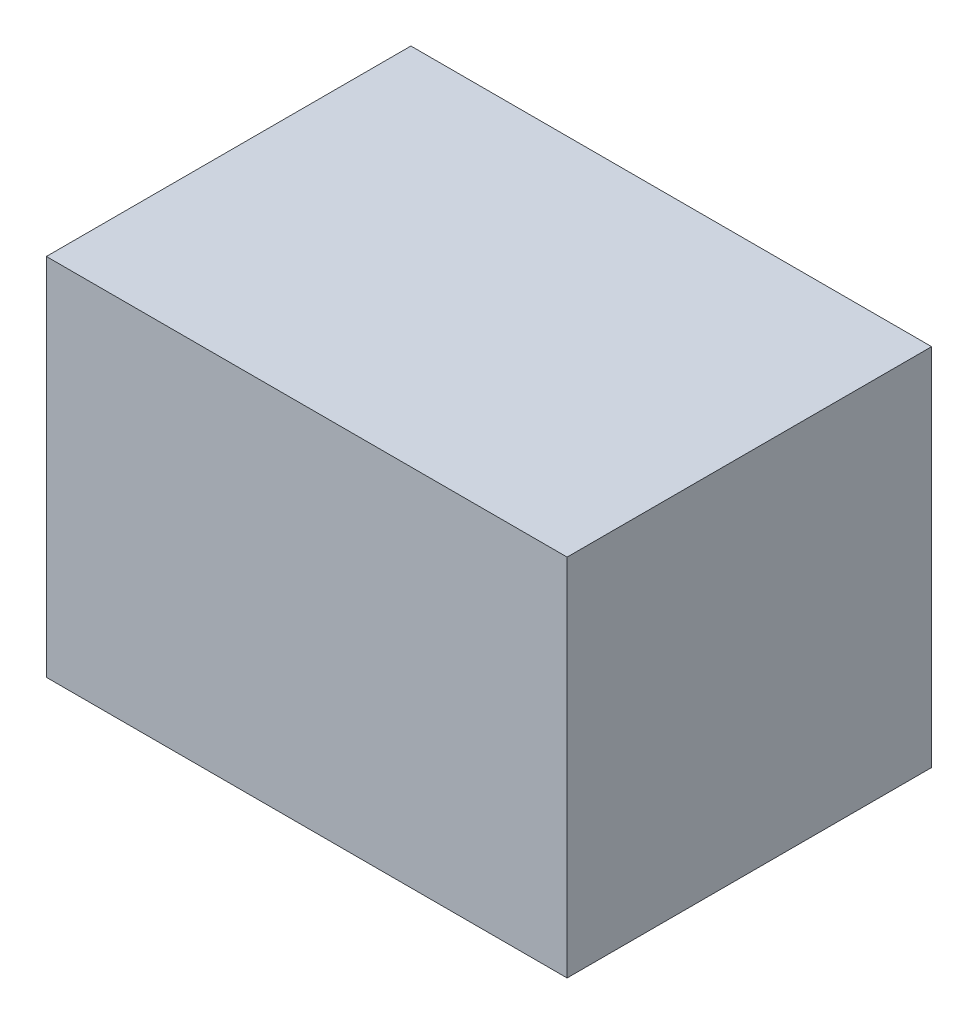
ISO-10303-21;
HEADER;
FILE_DESCRIPTION(('STEP AP214'),'2;1');
FILE_NAME('part.step','',(''),(''),'','','');
FILE_SCHEMA(('AUTOMOTIVE_DESIGN { 1 0 10303 214 1 1 1 1 }'));
ENDSEC;
DATA;
#1=APPLICATION_CONTEXT('core data for automotive mechanical design processes');
#2=APPLICATION_PROTOCOL_DEFINITION('international standard','automotive_design',2000,#1);
#3=PRODUCT_CONTEXT('',#1,'mechanical');
#4=PRODUCT('Part','Part','',(#3));
#5=PRODUCT_RELATED_PRODUCT_CATEGORY('part','',(#4));
#6=PRODUCT_DEFINITION_FORMATION('','',#4);
#7=PRODUCT_DEFINITION_CONTEXT('part definition',#1,'design');
#8=PRODUCT_DEFINITION('design','',#6,#7);
#9=PRODUCT_DEFINITION_SHAPE('','',#8);
#10=(LENGTH_UNIT() NAMED_UNIT(*) SI_UNIT(.MILLI.,.METRE.));
#11=(NAMED_UNIT(*) PLANE_ANGLE_UNIT() SI_UNIT($,.RADIAN.));
#12=(NAMED_UNIT(*) SI_UNIT($,.STERADIAN.) SOLID_ANGLE_UNIT());
#13=UNCERTAINTY_MEASURE_WITH_UNIT(LENGTH_MEASURE(1.E-05),#10,'distance_accuracy_value','');
#14=(GEOMETRIC_REPRESENTATION_CONTEXT(3) GLOBAL_UNCERTAINTY_ASSIGNED_CONTEXT((#13)) GLOBAL_UNIT_ASSIGNED_CONTEXT((#10,
#11,#12)) REPRESENTATION_CONTEXT('',''));
#15=CARTESIAN_POINT('',(0.,0.,0.));
#16=DIRECTION('',(0.,0.,1.));
#17=DIRECTION('',(1.,0.,0.));
#18=AXIS2_PLACEMENT_3D('',#15,#16,#17);
#19=CARTESIAN_POINT('',(-17.78,0.,0.));
#20=DIRECTION('',(0.,-1.,0.));
#21=DIRECTION('',(0.,0.,-1.));
#22=AXIS2_PLACEMENT_3D('',#19,#20,#21);
#23=PLANE('',#22);
#24=DIRECTION('',(1.,0.,0.));
#25=VECTOR('',#24,1.);
#26=CARTESIAN_POINT('',(-17.78,0.,-1.1));
#27=LINE('',#26,#25);
#28=CARTESIAN_POINT('',(-2.79,0.,-1.1));
#29=VERTEX_POINT('',#28);
#30=CARTESIAN_POINT('',(-2.29,0.,-1.1));
#31=VERTEX_POINT('',#30);
#32=EDGE_CURVE('E91',#29,#31,#27,.T.);
#33=ORIENTED_EDGE('',*,*,#32,.F.);
#34=DIRECTION('',(0.,0.,1.));
#35=VECTOR('',#34,1.);
#36=CARTESIAN_POINT('',(-2.79,0.,0.));
#37=LINE('',#36,#35);
#38=CARTESIAN_POINT('',(-2.79,0.,-0.75));
#39=VERTEX_POINT('',#38);
#40=EDGE_CURVE('E26',#29,#39,#37,.T.);
#41=ORIENTED_EDGE('',*,*,#40,.T.);
#42=DIRECTION('',(1.,0.,0.));
#43=VECTOR('',#42,1.);
#44=CARTESIAN_POINT('',(-17.78,0.,-0.75));
#45=LINE('',#44,#43);
#46=CARTESIAN_POINT('',(-2.29,0.,-0.75));
#47=VERTEX_POINT('',#46);
#48=EDGE_CURVE('E110',#39,#47,#45,.T.);
#49=ORIENTED_EDGE('',*,*,#48,.T.);
#50=DIRECTION('',(0.,0.,1.));
#51=VECTOR('',#50,1.);
#52=CARTESIAN_POINT('',(-2.29,0.,0.));
#53=LINE('',#52,#51);
#54=EDGE_CURVE('E80',#31,#47,#53,.T.);
#55=ORIENTED_EDGE('',*,*,#54,.F.);
#56=EDGE_LOOP('',(#33,#41,#49,#55));
#57=FACE_BOUND('',#56,.T.);
#58=ADVANCED_FACE('F17',(#57),#23,.F.);
#59=CARTESIAN_POINT('',(-17.78,-0.35,0.));
#60=DIRECTION('',(0.,-1.,0.));
#61=DIRECTION('',(0.,0.,-1.));
#62=AXIS2_PLACEMENT_3D('',#59,#60,#61);
#63=PLANE('',#62);
#64=DIRECTION('',(1.,0.,0.));
#65=VECTOR('',#64,1.);
#66=CARTESIAN_POINT('',(-17.78,-0.35,-1.1));
#67=LINE('',#66,#65);
#68=CARTESIAN_POINT('',(-2.79,-0.35,-1.1));
#69=VERTEX_POINT('',#68);
#70=CARTESIAN_POINT('',(-2.29,-0.35,-1.1));
#71=VERTEX_POINT('',#70);
#72=EDGE_CURVE('E69',#69,#71,#67,.T.);
#73=ORIENTED_EDGE('',*,*,#72,.T.);
#74=DIRECTION('',(0.,0.,1.));
#75=VECTOR('',#74,1.);
#76=CARTESIAN_POINT('',(-2.29,-0.35,0.));
#77=LINE('',#76,#75);
#78=CARTESIAN_POINT('',(-2.29,-0.35,-0.75));
#79=VERTEX_POINT('',#78);
#80=EDGE_CURVE('E97',#71,#79,#77,.T.);
#81=ORIENTED_EDGE('',*,*,#80,.T.);
#82=DIRECTION('',(1.,0.,0.));
#83=VECTOR('',#82,1.);
#84=CARTESIAN_POINT('',(-17.78,-0.35,-0.75));
#85=LINE('',#84,#83);
#86=CARTESIAN_POINT('',(-2.79,-0.35,-0.75));
#87=VERTEX_POINT('',#86);
#88=EDGE_CURVE('E71',#87,#79,#85,.T.);
#89=ORIENTED_EDGE('',*,*,#88,.F.);
#90=DIRECTION('',(0.,0.,1.));
#91=VECTOR('',#90,1.);
#92=CARTESIAN_POINT('',(-2.79,-0.35,0.));
#93=LINE('',#92,#91);
#94=EDGE_CURVE('E11',#69,#87,#93,.T.);
#95=ORIENTED_EDGE('',*,*,#94,.F.);
#96=EDGE_LOOP('',(#73,#81,#89,#95));
#97=FACE_BOUND('',#96,.T.);
#98=ADVANCED_FACE('F66',(#97),#63,.T.);
#99=CARTESIAN_POINT('',(-2.79,-0.35,0.));
#100=DIRECTION('',(-1.,0.,0.));
#101=DIRECTION('',(0.,0.,1.));
#102=AXIS2_PLACEMENT_3D('',#99,#100,#101);
#103=PLANE('',#102);
#104=ORIENTED_EDGE('',*,*,#40,.F.);
#105=DIRECTION('',(0.,1.,0.));
#106=VECTOR('',#105,1.);
#107=CARTESIAN_POINT('',(-2.79,-0.35,-1.1));
#108=LINE('',#107,#106);
#109=EDGE_CURVE('E74',#69,#29,#108,.T.);
#110=ORIENTED_EDGE('',*,*,#109,.F.);
#111=ORIENTED_EDGE('',*,*,#94,.T.);
#112=DIRECTION('',(0.,1.,0.));
#113=VECTOR('',#112,1.);
#114=CARTESIAN_POINT('',(-2.79,-0.35,-0.75));
#115=LINE('',#114,#113);
#116=EDGE_CURVE('E103',#87,#39,#115,.T.);
#117=ORIENTED_EDGE('',*,*,#116,.T.);
#118=EDGE_LOOP('',(#104,#110,#111,#117));
#119=FACE_BOUND('',#118,.T.);
#120=ADVANCED_FACE('F75',(#119),#103,.T.);
#121=CARTESIAN_POINT('',(-17.78,-0.35,-0.75));
#122=DIRECTION('',(0.,0.,1.));
#123=DIRECTION('',(1.,0.,0.));
#124=AXIS2_PLACEMENT_3D('',#121,#122,#123);
#125=PLANE('',#124);
#126=ORIENTED_EDGE('',*,*,#48,.F.);
#127=ORIENTED_EDGE('',*,*,#116,.F.);
#128=ORIENTED_EDGE('',*,*,#88,.T.);
#129=DIRECTION('',(0.,1.,0.));
#130=VECTOR('',#129,1.);
#131=CARTESIAN_POINT('',(-2.29,-0.35,-0.75));
#132=LINE('',#131,#130);
#133=EDGE_CURVE('E95',#79,#47,#132,.T.);
#134=ORIENTED_EDGE('',*,*,#133,.T.);
#135=EDGE_LOOP('',(#126,#127,#128,#134));
#136=FACE_BOUND('',#135,.T.);
#137=ADVANCED_FACE('F174',(#136),#125,.T.);
#138=CARTESIAN_POINT('',(-2.29,-0.35,0.));
#139=DIRECTION('',(-1.,0.,0.));
#140=DIRECTION('',(0.,0.,1.));
#141=AXIS2_PLACEMENT_3D('',#138,#139,#140);
#142=PLANE('',#141);
#143=ORIENTED_EDGE('',*,*,#54,.T.);
#144=ORIENTED_EDGE('',*,*,#133,.F.);
#145=ORIENTED_EDGE('',*,*,#80,.F.);
#146=DIRECTION('',(0.,1.,0.));
#147=VECTOR('',#146,1.);
#148=CARTESIAN_POINT('',(-2.29,-0.35,-1.1));
#149=LINE('',#148,#147);
#150=EDGE_CURVE('E84',#71,#31,#149,.T.);
#151=ORIENTED_EDGE('',*,*,#150,.T.);
#152=EDGE_LOOP('',(#143,#144,#145,#151));
#153=FACE_BOUND('',#152,.T.);
#154=ADVANCED_FACE('F128',(#153),#142,.F.);
#155=CARTESIAN_POINT('',(-17.78,-0.35,-1.1));
#156=DIRECTION('',(0.,0.,1.));
#157=DIRECTION('',(1.,0.,0.));
#158=AXIS2_PLACEMENT_3D('',#155,#156,#157);
#159=PLANE('',#158);
#160=ORIENTED_EDGE('',*,*,#32,.T.);
#161=ORIENTED_EDGE('',*,*,#150,.F.);
#162=ORIENTED_EDGE('',*,*,#72,.F.);
#163=ORIENTED_EDGE('',*,*,#109,.T.);
#164=EDGE_LOOP('',(#160,#161,#162,#163));
#165=FACE_BOUND('',#164,.T.);
#166=ADVANCED_FACE('F82',(#165),#159,.F.);
#167=CLOSED_SHELL('',(#58,#98,#120,#137,#154,#166));
#168=MANIFOLD_SOLID_BREP('B1',#167);
#169=ADVANCED_BREP_SHAPE_REPRESENTATION('',(#18,#168),#14);
#170=SHAPE_DEFINITION_REPRESENTATION(#9,#169);
ENDSEC;
END-ISO-10303-21;
